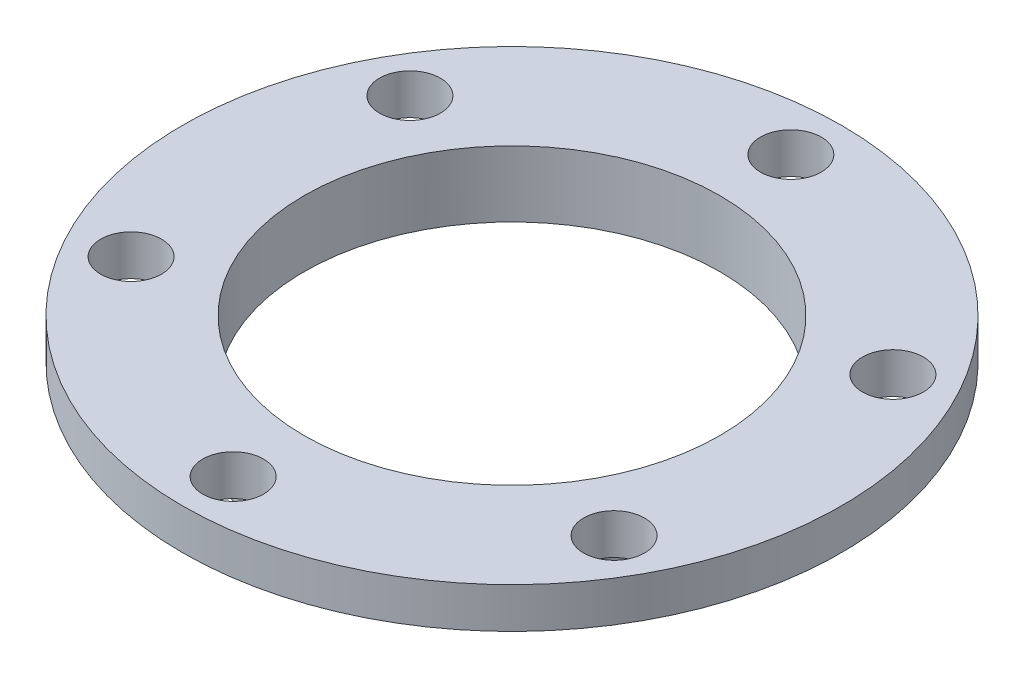
ISO-10303-21;
HEADER;
FILE_DESCRIPTION(('STEP AP214'),'2;1');
FILE_NAME('part.step','',(''),(''),'','','');
FILE_SCHEMA(('AUTOMOTIVE_DESIGN { 1 0 10303 214 1 1 1 1 }'));
ENDSEC;
DATA;
#1=APPLICATION_CONTEXT('core data for automotive mechanical design processes');
#2=APPLICATION_PROTOCOL_DEFINITION('international standard','automotive_design',2000,#1);
#3=PRODUCT_CONTEXT('',#1,'mechanical');
#4=PRODUCT('Part','Part','',(#3));
#5=PRODUCT_RELATED_PRODUCT_CATEGORY('part','',(#4));
#6=PRODUCT_DEFINITION_FORMATION('','',#4);
#7=PRODUCT_DEFINITION_CONTEXT('part definition',#1,'design');
#8=PRODUCT_DEFINITION('design','',#6,#7);
#9=PRODUCT_DEFINITION_SHAPE('','',#8);
#10=(LENGTH_UNIT() NAMED_UNIT(*) SI_UNIT(.MILLI.,.METRE.));
#11=(NAMED_UNIT(*) PLANE_ANGLE_UNIT() SI_UNIT($,.RADIAN.));
#12=(NAMED_UNIT(*) SI_UNIT($,.STERADIAN.) SOLID_ANGLE_UNIT());
#13=UNCERTAINTY_MEASURE_WITH_UNIT(LENGTH_MEASURE(1.E-05),#10,'distance_accuracy_value','');
#14=(GEOMETRIC_REPRESENTATION_CONTEXT(3) GLOBAL_UNCERTAINTY_ASSIGNED_CONTEXT((#13)) GLOBAL_UNIT_ASSIGNED_CONTEXT((#10,
#11,#12)) REPRESENTATION_CONTEXT('',''));
#15=CARTESIAN_POINT('',(0.,0.,0.));
#16=DIRECTION('',(0.,0.,1.));
#17=DIRECTION('',(1.,0.,0.));
#18=AXIS2_PLACEMENT_3D('',#15,#16,#17);
#19=CARTESIAN_POINT('',(0.,0.,0.));
#20=DIRECTION('',(0.,1.,0.));
#21=DIRECTION('',(0.,0.,1.));
#22=AXIS2_PLACEMENT_3D('',#19,#20,#21);
#23=PLANE('',#22);
#24=CARTESIAN_POINT('',(0.,0.,-27.5));
#25=DIRECTION('',(0.,1.,0.));
#26=DIRECTION('',(0.,0.,1.));
#27=AXIS2_PLACEMENT_3D('',#24,#25,#26);
#28=CIRCLE('',#27,3.);
#29=CARTESIAN_POINT('',(0.,0.,-24.5));
#30=VERTEX_POINT('',#29);
#31=EDGE_CURVE('E82',#30,#30,#28,.T.);
#32=ORIENTED_EDGE('',*,*,#31,.T.);
#33=EDGE_LOOP('',(#32));
#34=FACE_BOUND('',#33,.T.);
#35=CARTESIAN_POINT('',(-23.8156986040715,0.,-13.749999999999));
#36=DIRECTION('',(0.,1.,0.));
#37=DIRECTION('',(0.,0.,1.));
#38=AXIS2_PLACEMENT_3D('',#35,#36,#37);
#39=CIRCLE('',#38,3.00000000000118);
#40=CARTESIAN_POINT('',(-23.8156986040715,0.,-10.7499999999978));
#41=VERTEX_POINT('',#40);
#42=EDGE_CURVE('E70',#41,#41,#39,.T.);
#43=ORIENTED_EDGE('',*,*,#42,.T.);
#44=EDGE_LOOP('',(#43));
#45=FACE_BOUND('',#44,.T.);
#46=CARTESIAN_POINT('',(-23.8156986040703,0.,13.750000000001));
#47=DIRECTION('',(0.,1.,0.));
#48=DIRECTION('',(0.,0.,1.));
#49=AXIS2_PLACEMENT_3D('',#46,#47,#48);
#50=CIRCLE('',#49,3.00000000000222);
#51=CARTESIAN_POINT('',(-23.8156986040703,0.,16.7500000000032));
#52=VERTEX_POINT('',#51);
#53=EDGE_CURVE('E67',#52,#52,#50,.T.);
#54=ORIENTED_EDGE('',*,*,#53,.T.);
#55=EDGE_LOOP('',(#54));
#56=FACE_BOUND('',#55,.T.);
#57=CARTESIAN_POINT('',(2.33468769191537E-12,0.,27.5));
#58=DIRECTION('',(0.,1.,0.));
#59=DIRECTION('',(0.,0.,1.));
#60=AXIS2_PLACEMENT_3D('',#57,#58,#59);
#61=CIRCLE('',#60,3.00000000000242);
#62=CARTESIAN_POINT('',(2.33468769191537E-12,0.,30.5000000000024));
#63=VERTEX_POINT('',#62);
#64=EDGE_CURVE('E64',#63,#63,#61,.T.);
#65=ORIENTED_EDGE('',*,*,#64,.T.);
#66=EDGE_LOOP('',(#65));
#67=FACE_BOUND('',#66,.T.);
#68=CARTESIAN_POINT('',(23.8156986040738,0.,13.749999999999));
#69=DIRECTION('',(0.,1.,0.));
#70=DIRECTION('',(0.,0.,1.));
#71=AXIS2_PLACEMENT_3D('',#68,#69,#70);
#72=CIRCLE('',#71,3.00000000000151);
#73=CARTESIAN_POINT('',(23.8156986040738,0.,16.7500000000005));
#74=VERTEX_POINT('',#73);
#75=EDGE_CURVE('E60',#74,#74,#72,.T.);
#76=ORIENTED_EDGE('',*,*,#75,.T.);
#77=EDGE_LOOP('',(#76));
#78=FACE_BOUND('',#77,.T.);
#79=CARTESIAN_POINT('',(23.8156986040726,0.,-13.750000000001));
#80=DIRECTION('',(0.,1.,0.));
#81=DIRECTION('',(0.,0.,1.));
#82=AXIS2_PLACEMENT_3D('',#79,#80,#81);
#83=CIRCLE('',#82,3.00000000000033);
#84=CARTESIAN_POINT('',(23.8156986040726,0.,-10.7500000000007));
#85=VERTEX_POINT('',#84);
#86=EDGE_CURVE('E56',#85,#85,#83,.T.);
#87=ORIENTED_EDGE('',*,*,#86,.T.);
#88=EDGE_LOOP('',(#87));
#89=FACE_BOUND('',#88,.T.);
#90=CARTESIAN_POINT('',(0.,0.,0.));
#91=DIRECTION('',(0.,1.,0.));
#92=DIRECTION('',(0.,0.,1.));
#93=AXIS2_PLACEMENT_3D('',#90,#91,#92);
#94=CIRCLE('',#93,32.5);
#95=CARTESIAN_POINT('',(0.,0.,32.5));
#96=VERTEX_POINT('',#95);
#97=EDGE_CURVE('E49',#96,#96,#94,.T.);
#98=ORIENTED_EDGE('',*,*,#97,.F.);
#99=EDGE_LOOP('',(#98));
#100=FACE_BOUND('',#99,.T.);
#101=CARTESIAN_POINT('',(0.,0.,0.));
#102=DIRECTION('',(0.,1.,0.));
#103=DIRECTION('',(0.,0.,1.));
#104=AXIS2_PLACEMENT_3D('',#101,#102,#103);
#105=CIRCLE('',#104,23.5);
#106=CARTESIAN_POINT('',(0.,0.,23.5));
#107=VERTEX_POINT('',#106);
#108=EDGE_CURVE('E10',#107,#107,#105,.F.);
#109=ORIENTED_EDGE('',*,*,#108,.F.);
#110=EDGE_LOOP('',(#109));
#111=FACE_BOUND('',#110,.T.);
#112=ADVANCED_FACE('F36',(#34,#45,#56,#67,#78,#89,#100,#111),#23,.F.);
#113=CARTESIAN_POINT('',(0.,4.,0.));
#114=DIRECTION('',(0.,1.,0.));
#115=DIRECTION('',(0.,0.,1.));
#116=AXIS2_PLACEMENT_3D('',#113,#114,#115);
#117=PLANE('',#116);
#118=CARTESIAN_POINT('',(0.,4.,-27.5));
#119=DIRECTION('',(0.,1.,0.));
#120=DIRECTION('',(0.,0.,1.));
#121=AXIS2_PLACEMENT_3D('',#118,#119,#120);
#122=CIRCLE('',#121,3.);
#123=CARTESIAN_POINT('',(0.,4.,-24.5));
#124=VERTEX_POINT('',#123);
#125=EDGE_CURVE('E40',#124,#124,#122,.T.);
#126=ORIENTED_EDGE('',*,*,#125,.F.);
#127=EDGE_LOOP('',(#126));
#128=FACE_BOUND('',#127,.T.);
#129=CARTESIAN_POINT('',(-23.8156986040715,4.,-13.749999999999));
#130=DIRECTION('',(0.,1.,0.));
#131=DIRECTION('',(0.,0.,1.));
#132=AXIS2_PLACEMENT_3D('',#129,#130,#131);
#133=CIRCLE('',#132,3.00000000000118);
#134=CARTESIAN_POINT('',(-23.8156986040715,4.,-10.7499999999978));
#135=VERTEX_POINT('',#134);
#136=EDGE_CURVE('E68',#135,#135,#133,.T.);
#137=ORIENTED_EDGE('',*,*,#136,.F.);
#138=EDGE_LOOP('',(#137));
#139=FACE_BOUND('',#138,.T.);
#140=CARTESIAN_POINT('',(-23.8156986040703,4.,13.750000000001));
#141=DIRECTION('',(0.,1.,0.));
#142=DIRECTION('',(0.,0.,1.));
#143=AXIS2_PLACEMENT_3D('',#140,#141,#142);
#144=CIRCLE('',#143,3.00000000000222);
#145=CARTESIAN_POINT('',(-23.8156986040703,4.,16.7500000000032));
#146=VERTEX_POINT('',#145);
#147=EDGE_CURVE('E65',#146,#146,#144,.T.);
#148=ORIENTED_EDGE('',*,*,#147,.F.);
#149=EDGE_LOOP('',(#148));
#150=FACE_BOUND('',#149,.T.);
#151=CARTESIAN_POINT('',(2.33468769191537E-12,4.,27.5));
#152=DIRECTION('',(0.,1.,0.));
#153=DIRECTION('',(0.,0.,1.));
#154=AXIS2_PLACEMENT_3D('',#151,#152,#153);
#155=CIRCLE('',#154,3.00000000000242);
#156=CARTESIAN_POINT('',(2.33468769191537E-12,4.,30.5000000000024));
#157=VERTEX_POINT('',#156);
#158=EDGE_CURVE('E61',#157,#157,#155,.T.);
#159=ORIENTED_EDGE('',*,*,#158,.F.);
#160=EDGE_LOOP('',(#159));
#161=FACE_BOUND('',#160,.T.);
#162=CARTESIAN_POINT('',(23.8156986040738,4.,13.749999999999));
#163=DIRECTION('',(0.,1.,0.));
#164=DIRECTION('',(0.,0.,1.));
#165=AXIS2_PLACEMENT_3D('',#162,#163,#164);
#166=CIRCLE('',#165,3.00000000000151);
#167=CARTESIAN_POINT('',(23.8156986040738,4.,16.7500000000005));
#168=VERTEX_POINT('',#167);
#169=EDGE_CURVE('E57',#168,#168,#166,.T.);
#170=ORIENTED_EDGE('',*,*,#169,.F.);
#171=EDGE_LOOP('',(#170));
#172=FACE_BOUND('',#171,.T.);
#173=CARTESIAN_POINT('',(23.8156986040726,4.,-13.750000000001));
#174=DIRECTION('',(0.,1.,0.));
#175=DIRECTION('',(0.,0.,1.));
#176=AXIS2_PLACEMENT_3D('',#173,#174,#175);
#177=CIRCLE('',#176,3.00000000000033);
#178=CARTESIAN_POINT('',(23.8156986040726,4.,-10.7500000000007));
#179=VERTEX_POINT('',#178);
#180=EDGE_CURVE('E53',#179,#179,#177,.T.);
#181=ORIENTED_EDGE('',*,*,#180,.F.);
#182=EDGE_LOOP('',(#181));
#183=FACE_BOUND('',#182,.T.);
#184=CARTESIAN_POINT('',(0.,4.,0.));
#185=DIRECTION('',(0.,1.,0.));
#186=DIRECTION('',(0.,0.,1.));
#187=AXIS2_PLACEMENT_3D('',#184,#185,#186);
#188=CIRCLE('',#187,32.5);
#189=CARTESIAN_POINT('',(0.,4.,32.5));
#190=VERTEX_POINT('',#189);
#191=EDGE_CURVE('E44',#190,#190,#188,.T.);
#192=ORIENTED_EDGE('',*,*,#191,.T.);
#193=EDGE_LOOP('',(#192));
#194=FACE_BOUND('',#193,.T.);
#195=CARTESIAN_POINT('',(0.,4.,0.));
#196=DIRECTION('',(0.,1.,0.));
#197=DIRECTION('',(0.,0.,1.));
#198=AXIS2_PLACEMENT_3D('',#195,#196,#197);
#199=CIRCLE('',#198,20.5);
#200=CARTESIAN_POINT('',(0.,4.,20.5));
#201=VERTEX_POINT('',#200);
#202=EDGE_CURVE('E91',#201,#201,#199,.T.);
#203=ORIENTED_EDGE('',*,*,#202,.F.);
#204=EDGE_LOOP('',(#203));
#205=FACE_BOUND('',#204,.T.);
#206=ADVANCED_FACE('F101',(#128,#139,#150,#161,#172,#183,#194,#205),#117,.T.);
#207=CARTESIAN_POINT('',(0.,4.,0.));
#208=DIRECTION('',(0.,-1.,0.));
#209=DIRECTION('',(0.,0.,-1.));
#210=AXIS2_PLACEMENT_3D('',#207,#208,#209);
#211=CYLINDRICAL_SURFACE('',#210,32.5);
#212=ORIENTED_EDGE('',*,*,#191,.F.);
#213=EDGE_LOOP('',(#212));
#214=FACE_BOUND('',#213,.T.);
#215=ORIENTED_EDGE('',*,*,#97,.T.);
#216=EDGE_LOOP('',(#215));
#217=FACE_BOUND('',#216,.T.);
#218=ADVANCED_FACE('F38',(#214,#217),#211,.T.);
#219=CARTESIAN_POINT('',(0.,4.,0.));
#220=DIRECTION('',(0.,-1.,0.));
#221=DIRECTION('',(0.,0.,-1.));
#222=AXIS2_PLACEMENT_3D('',#219,#220,#221);
#223=CYLINDRICAL_SURFACE('',#222,20.5);
#224=ORIENTED_EDGE('',*,*,#202,.T.);
#225=EDGE_LOOP('',(#224));
#226=FACE_BOUND('',#225,.T.);
#227=CARTESIAN_POINT('',(0.,-2.5,0.));
#228=DIRECTION('',(0.,-1.,0.));
#229=DIRECTION('',(0.,0.,-1.));
#230=AXIS2_PLACEMENT_3D('',#227,#228,#229);
#231=CIRCLE('',#230,20.5);
#232=CARTESIAN_POINT('',(0.,-2.5,-20.5));
#233=VERTEX_POINT('',#232);
#234=EDGE_CURVE('E85',#233,#233,#231,.T.);
#235=ORIENTED_EDGE('',*,*,#234,.T.);
#236=EDGE_LOOP('',(#235));
#237=FACE_BOUND('',#236,.T.);
#238=ADVANCED_FACE('F110',(#226,#237),#223,.F.);
#239=CARTESIAN_POINT('',(0.,-2.5,0.));
#240=DIRECTION('',(0.,-1.,0.));
#241=DIRECTION('',(0.,0.,-1.));
#242=AXIS2_PLACEMENT_3D('',#239,#240,#241);
#243=PLANE('',#242);
#244=CARTESIAN_POINT('',(0.,-2.5,0.));
#245=DIRECTION('',(0.,-1.,0.));
#246=DIRECTION('',(0.,0.,-1.));
#247=AXIS2_PLACEMENT_3D('',#244,#245,#246);
#248=CIRCLE('',#247,23.5);
#249=CARTESIAN_POINT('',(0.,-2.5,-23.5));
#250=VERTEX_POINT('',#249);
#251=EDGE_CURVE('E88',#250,#250,#248,.T.);
#252=ORIENTED_EDGE('',*,*,#251,.T.);
#253=EDGE_LOOP('',(#252));
#254=FACE_BOUND('',#253,.T.);
#255=ORIENTED_EDGE('',*,*,#234,.F.);
#256=EDGE_LOOP('',(#255));
#257=FACE_BOUND('',#256,.T.);
#258=ADVANCED_FACE('F113',(#254,#257),#243,.T.);
#259=CARTESIAN_POINT('',(0.,-2.5,0.));
#260=DIRECTION('',(0.,1.,0.));
#261=DIRECTION('',(0.,0.,1.));
#262=AXIS2_PLACEMENT_3D('',#259,#260,#261);
#263=CYLINDRICAL_SURFACE('',#262,23.5);
#264=ORIENTED_EDGE('',*,*,#251,.F.);
#265=EDGE_LOOP('',(#264));
#266=FACE_BOUND('',#265,.T.);
#267=ORIENTED_EDGE('',*,*,#108,.T.);
#268=EDGE_LOOP('',(#267));
#269=FACE_BOUND('',#268,.T.);
#270=ADVANCED_FACE('F114',(#266,#269),#263,.T.);
#271=CARTESIAN_POINT('',(23.8156986040726,-2.5,-13.750000000001));
#272=DIRECTION('',(0.,1.,0.));
#273=DIRECTION('',(0.,0.,1.));
#274=AXIS2_PLACEMENT_3D('',#271,#272,#273);
#275=CYLINDRICAL_SURFACE('',#274,3.00000000000033);
#276=ORIENTED_EDGE('',*,*,#180,.T.);
#277=EDGE_LOOP('',(#276));
#278=FACE_BOUND('',#277,.T.);
#279=ORIENTED_EDGE('',*,*,#86,.F.);
#280=EDGE_LOOP('',(#279));
#281=FACE_BOUND('',#280,.T.);
#282=ADVANCED_FACE('F117',(#278,#281),#275,.F.);
#283=CARTESIAN_POINT('',(23.8156986040738,-2.5,13.749999999999));
#284=DIRECTION('',(0.,1.,0.));
#285=DIRECTION('',(0.,0.,1.));
#286=AXIS2_PLACEMENT_3D('',#283,#284,#285);
#287=CYLINDRICAL_SURFACE('',#286,3.00000000000151);
#288=ORIENTED_EDGE('',*,*,#169,.T.);
#289=EDGE_LOOP('',(#288));
#290=FACE_BOUND('',#289,.T.);
#291=ORIENTED_EDGE('',*,*,#75,.F.);
#292=EDGE_LOOP('',(#291));
#293=FACE_BOUND('',#292,.T.);
#294=ADVANCED_FACE('F130',(#290,#293),#287,.F.);
#295=CARTESIAN_POINT('',(2.33468769191537E-12,-2.5,27.5));
#296=DIRECTION('',(0.,1.,0.));
#297=DIRECTION('',(0.,0.,1.));
#298=AXIS2_PLACEMENT_3D('',#295,#296,#297);
#299=CYLINDRICAL_SURFACE('',#298,3.00000000000242);
#300=ORIENTED_EDGE('',*,*,#158,.T.);
#301=EDGE_LOOP('',(#300));
#302=FACE_BOUND('',#301,.T.);
#303=ORIENTED_EDGE('',*,*,#64,.F.);
#304=EDGE_LOOP('',(#303));
#305=FACE_BOUND('',#304,.T.);
#306=ADVANCED_FACE('F126',(#302,#305),#299,.F.);
#307=CARTESIAN_POINT('',(-23.8156986040703,-2.5,13.750000000001));
#308=DIRECTION('',(0.,1.,0.));
#309=DIRECTION('',(0.,0.,1.));
#310=AXIS2_PLACEMENT_3D('',#307,#308,#309);
#311=CYLINDRICAL_SURFACE('',#310,3.00000000000222);
#312=ORIENTED_EDGE('',*,*,#147,.T.);
#313=EDGE_LOOP('',(#312));
#314=FACE_BOUND('',#313,.T.);
#315=ORIENTED_EDGE('',*,*,#53,.F.);
#316=EDGE_LOOP('',(#315));
#317=FACE_BOUND('',#316,.T.);
#318=ADVANCED_FACE('F122',(#314,#317),#311,.F.);
#319=CARTESIAN_POINT('',(-23.8156986040715,-2.5,-13.749999999999));
#320=DIRECTION('',(0.,1.,0.));
#321=DIRECTION('',(0.,0.,1.));
#322=AXIS2_PLACEMENT_3D('',#319,#320,#321);
#323=CYLINDRICAL_SURFACE('',#322,3.00000000000118);
#324=ORIENTED_EDGE('',*,*,#136,.T.);
#325=EDGE_LOOP('',(#324));
#326=FACE_BOUND('',#325,.T.);
#327=ORIENTED_EDGE('',*,*,#42,.F.);
#328=EDGE_LOOP('',(#327));
#329=FACE_BOUND('',#328,.T.);
#330=ADVANCED_FACE('F125',(#326,#329),#323,.F.);
#331=CARTESIAN_POINT('',(0.,-2.5,-27.5));
#332=DIRECTION('',(0.,1.,0.));
#333=DIRECTION('',(0.,0.,1.));
#334=AXIS2_PLACEMENT_3D('',#331,#332,#333);
#335=CYLINDRICAL_SURFACE('',#334,3.);
#336=ORIENTED_EDGE('',*,*,#125,.T.);
#337=EDGE_LOOP('',(#336));
#338=FACE_BOUND('',#337,.T.);
#339=ORIENTED_EDGE('',*,*,#31,.F.);
#340=EDGE_LOOP('',(#339));
#341=FACE_BOUND('',#340,.T.);
#342=ADVANCED_FACE('F140',(#338,#341),#335,.F.);
#343=CLOSED_SHELL('',(#112,#206,#218,#238,#258,#270,#282,#294,#306,#318,#330,#342));
#344=MANIFOLD_SOLID_BREP('B2',#343);
#345=ADVANCED_BREP_SHAPE_REPRESENTATION('',(#18,#344),#14);
#346=SHAPE_DEFINITION_REPRESENTATION(#9,#345);
ENDSEC;
END-ISO-10303-21;
